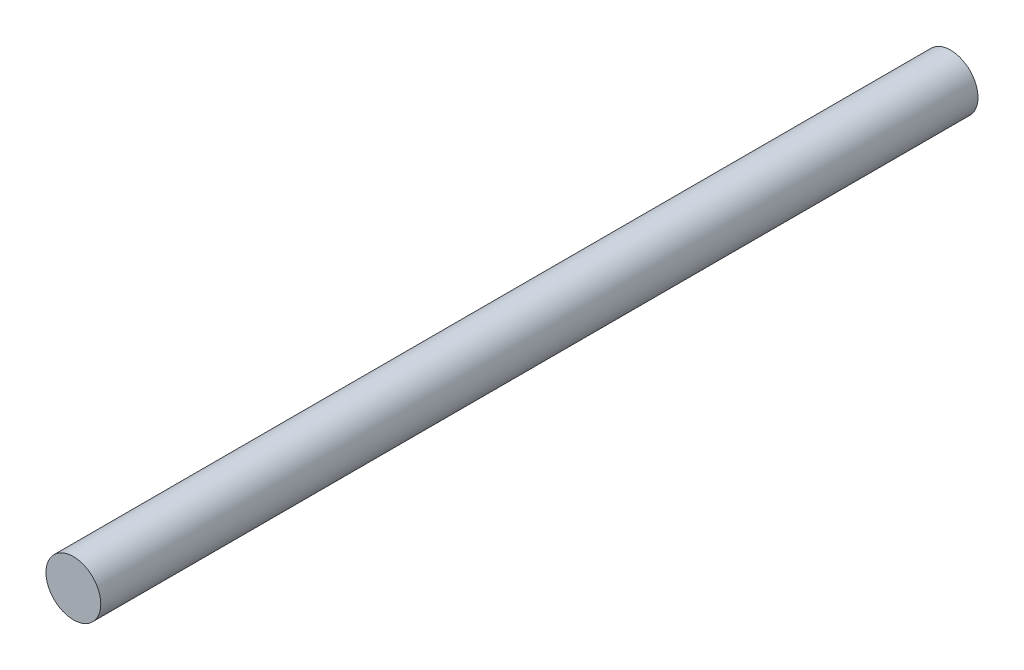
ISO-10303-21;
HEADER;
FILE_DESCRIPTION(('STEP AP214'),'2;1');
FILE_NAME('part.step','',(''),(''),'','','');
FILE_SCHEMA(('AUTOMOTIVE_DESIGN { 1 0 10303 214 1 1 1 1 }'));
ENDSEC;
DATA;
#1=APPLICATION_CONTEXT('core data for automotive mechanical design processes');
#2=APPLICATION_PROTOCOL_DEFINITION('international standard','automotive_design',2000,#1);
#3=PRODUCT_CONTEXT('',#1,'mechanical');
#4=PRODUCT('Part','Part','',(#3));
#5=PRODUCT_RELATED_PRODUCT_CATEGORY('part','',(#4));
#6=PRODUCT_DEFINITION_FORMATION('','',#4);
#7=PRODUCT_DEFINITION_CONTEXT('part definition',#1,'design');
#8=PRODUCT_DEFINITION('design','',#6,#7);
#9=PRODUCT_DEFINITION_SHAPE('','',#8);
#10=(LENGTH_UNIT() NAMED_UNIT(*) SI_UNIT(.MILLI.,.METRE.));
#11=(NAMED_UNIT(*) PLANE_ANGLE_UNIT() SI_UNIT($,.RADIAN.));
#12=(NAMED_UNIT(*) SI_UNIT($,.STERADIAN.) SOLID_ANGLE_UNIT());
#13=UNCERTAINTY_MEASURE_WITH_UNIT(LENGTH_MEASURE(1.E-05),#10,'distance_accuracy_value','');
#14=(GEOMETRIC_REPRESENTATION_CONTEXT(3) GLOBAL_UNCERTAINTY_ASSIGNED_CONTEXT((#13)) GLOBAL_UNIT_ASSIGNED_CONTEXT((#10,
#11,#12)) REPRESENTATION_CONTEXT('',''));
#15=CARTESIAN_POINT('',(0.,0.,0.));
#16=DIRECTION('',(0.,0.,1.));
#17=DIRECTION('',(1.,0.,0.));
#18=AXIS2_PLACEMENT_3D('',#15,#16,#17);
#19=CARTESIAN_POINT('',(2.83153519297258,2.800471083678,50.8));
#20=DIRECTION('',(0.,0.,-1.));
#21=DIRECTION('',(-1.,0.,0.));
#22=AXIS2_PLACEMENT_3D('',#19,#20,#21);
#23=CYLINDRICAL_SURFACE('',#22,1.5875);
#24=CARTESIAN_POINT('',(2.83153519297258,2.800471083678,50.8));
#25=DIRECTION('',(0.,0.,1.));
#26=DIRECTION('',(1.,0.,0.));
#27=AXIS2_PLACEMENT_3D('',#24,#25,#26);
#28=CIRCLE('',#27,1.5875);
#29=CARTESIAN_POINT('',(4.41903519297258,2.800471083678,50.8));
#30=VERTEX_POINT('',#29);
#31=EDGE_CURVE('E10',#30,#30,#28,.T.);
#32=ORIENTED_EDGE('',*,*,#31,.F.);
#33=EDGE_LOOP('',(#32));
#34=FACE_BOUND('',#33,.T.);
#35=CARTESIAN_POINT('',(2.83153519297258,2.800471083678,0.));
#36=DIRECTION('',(0.,0.,1.));
#37=DIRECTION('',(1.,0.,0.));
#38=AXIS2_PLACEMENT_3D('',#35,#36,#37);
#39=CIRCLE('',#38,1.5875);
#40=CARTESIAN_POINT('',(4.41903519297258,2.800471083678,0.));
#41=VERTEX_POINT('',#40);
#42=EDGE_CURVE('E36',#41,#41,#39,.T.);
#43=ORIENTED_EDGE('',*,*,#42,.T.);
#44=EDGE_LOOP('',(#43));
#45=FACE_BOUND('',#44,.T.);
#46=ADVANCED_FACE('F33',(#34,#45),#23,.T.);
#47=CARTESIAN_POINT('',(2.83153519297258,2.800471083678,50.8));
#48=DIRECTION('',(0.,0.,1.));
#49=DIRECTION('',(1.,0.,0.));
#50=AXIS2_PLACEMENT_3D('',#47,#48,#49);
#51=PLANE('',#50);
#52=ORIENTED_EDGE('',*,*,#31,.T.);
#53=EDGE_LOOP('',(#52));
#54=FACE_BOUND('',#53,.T.);
#55=ADVANCED_FACE('F48',(#54),#51,.T.);
#56=CARTESIAN_POINT('',(2.83153519297258,2.800471083678,0.));
#57=DIRECTION('',(0.,0.,1.));
#58=DIRECTION('',(1.,0.,0.));
#59=AXIS2_PLACEMENT_3D('',#56,#57,#58);
#60=PLANE('',#59);
#61=ORIENTED_EDGE('',*,*,#42,.F.);
#62=EDGE_LOOP('',(#61));
#63=FACE_BOUND('',#62,.T.);
#64=ADVANCED_FACE('F46',(#63),#60,.F.);
#65=CLOSED_SHELL('',(#46,#55,#64));
#66=MANIFOLD_SOLID_BREP('B2',#65);
#67=ADVANCED_BREP_SHAPE_REPRESENTATION('',(#18,#66),#14);
#68=SHAPE_DEFINITION_REPRESENTATION(#9,#67);
ENDSEC;
END-ISO-10303-21;
